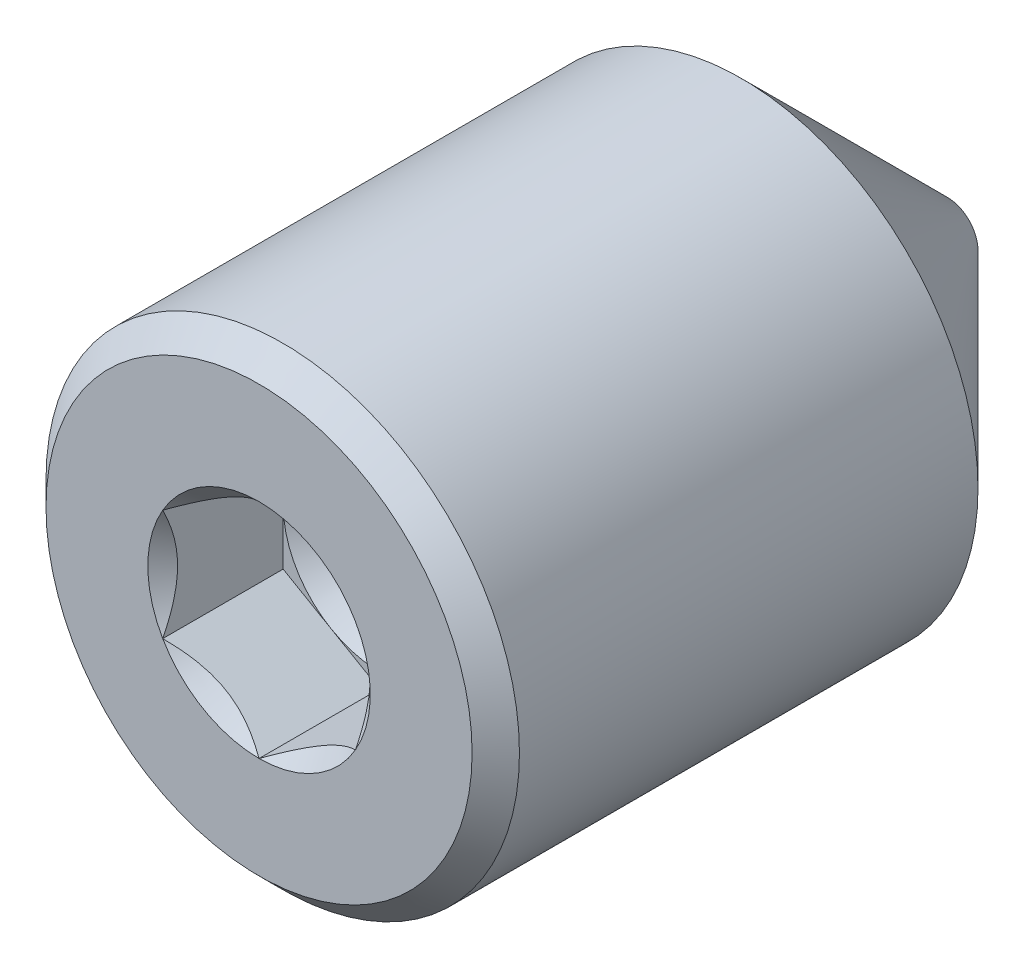
ISO-10303-21;
HEADER;
FILE_DESCRIPTION(('STEP AP214'),'2;1');
FILE_NAME('part.step','',(''),(''),'','','');
FILE_SCHEMA(('AUTOMOTIVE_DESIGN { 1 0 10303 214 1 1 1 1 }'));
ENDSEC;
DATA;
#1=APPLICATION_CONTEXT('core data for automotive mechanical design processes');
#2=APPLICATION_PROTOCOL_DEFINITION('international standard','automotive_design',2000,#1);
#3=PRODUCT_CONTEXT('',#1,'mechanical');
#4=PRODUCT('Part','Part','',(#3));
#5=PRODUCT_RELATED_PRODUCT_CATEGORY('part','',(#4));
#6=PRODUCT_DEFINITION_FORMATION('','',#4);
#7=PRODUCT_DEFINITION_CONTEXT('part definition',#1,'design');
#8=PRODUCT_DEFINITION('design','',#6,#7);
#9=PRODUCT_DEFINITION_SHAPE('','',#8);
#10=(LENGTH_UNIT() NAMED_UNIT(*) SI_UNIT(.MILLI.,.METRE.));
#11=(NAMED_UNIT(*) PLANE_ANGLE_UNIT() SI_UNIT($,.RADIAN.));
#12=(NAMED_UNIT(*) SI_UNIT($,.STERADIAN.) SOLID_ANGLE_UNIT());
#13=UNCERTAINTY_MEASURE_WITH_UNIT(LENGTH_MEASURE(1.E-05),#10,'distance_accuracy_value','');
#14=(GEOMETRIC_REPRESENTATION_CONTEXT(3) GLOBAL_UNCERTAINTY_ASSIGNED_CONTEXT((#13)) GLOBAL_UNIT_ASSIGNED_CONTEXT((#10,
#11,#12)) REPRESENTATION_CONTEXT('',''));
#15=CARTESIAN_POINT('',(0.,0.,0.));
#16=DIRECTION('',(0.,0.,1.));
#17=DIRECTION('',(1.,0.,0.));
#18=AXIS2_PLACEMENT_3D('',#15,#16,#17);
#19=CARTESIAN_POINT('',(0.,0.,1.031875));
#20=DIRECTION('',(0.,0.,1.));
#21=DIRECTION('',(1.,0.,0.));
#22=AXIS2_PLACEMENT_3D('',#19,#20,#21);
#23=PLANE('',#22);
#24=CARTESIAN_POINT('',(0.,0.,1.031875));
#25=DIRECTION('',(0.,0.,1.));
#26=DIRECTION('',(1.,0.,0.));
#27=AXIS2_PLACEMENT_3D('',#24,#25,#26);
#28=CIRCLE('',#27,0.4445);
#29=CARTESIAN_POINT('',(0.4445,0.,1.031875));
#30=VERTEX_POINT('',#29);
#31=CARTESIAN_POINT('',(0.22225,0.384948291982183,1.031875));
#32=VERTEX_POINT('',#31);
#33=EDGE_CURVE('E128',#30,#32,#28,.T.);
#34=ORIENTED_EDGE('',*,*,#33,.F.);
#35=DIRECTION('',(0.,1.,0.));
#36=VECTOR('',#35,1.);
#37=CARTESIAN_POINT('',(0.4445,-0.256632194654789,1.031875));
#38=LINE('',#37,#36);
#39=CARTESIAN_POINT('',(0.4445,0.256632194654789,1.031875));
#40=VERTEX_POINT('',#39);
#41=EDGE_CURVE('E160',#30,#40,#38,.T.);
#42=ORIENTED_EDGE('',*,*,#41,.T.);
#43=DIRECTION('',(-0.866025403784439,0.5,0.));
#44=VECTOR('',#43,1.);
#45=CARTESIAN_POINT('',(0.4445,0.256632194654789,1.031875));
#46=LINE('',#45,#44);
#47=EDGE_CURVE('E153',#40,#32,#46,.T.);
#48=ORIENTED_EDGE('',*,*,#47,.T.);
#49=EDGE_LOOP('',(#34,#42,#48));
#50=FACE_BOUND('',#49,.T.);
#51=ADVANCED_FACE('F43',(#50),#23,.T.);
#52=CARTESIAN_POINT('',(-0.22225,0.384948291982183,1.031875));
#53=VERTEX_POINT('',#52);
#54=EDGE_CURVE('E130',#32,#53,#28,.T.);
#55=ORIENTED_EDGE('',*,*,#54,.F.);
#56=CARTESIAN_POINT('',(0.,0.513264389309577,1.031875));
#57=VERTEX_POINT('',#56);
#58=EDGE_CURVE('E143',#32,#57,#46,.T.);
#59=ORIENTED_EDGE('',*,*,#58,.T.);
#60=DIRECTION('',(-0.866025403784439,-0.5,0.));
#61=VECTOR('',#60,1.);
#62=CARTESIAN_POINT('',(0.,0.513264389309577,1.031875));
#63=LINE('',#62,#61);
#64=EDGE_CURVE('E146',#57,#53,#63,.T.);
#65=ORIENTED_EDGE('',*,*,#64,.T.);
#66=EDGE_LOOP('',(#55,#59,#65));
#67=FACE_BOUND('',#66,.T.);
#68=ADVANCED_FACE('F142',(#67),#23,.T.);
#69=CARTESIAN_POINT('',(-0.4445,0.,1.031875));
#70=VERTEX_POINT('',#69);
#71=EDGE_CURVE('E148',#53,#70,#28,.T.);
#72=ORIENTED_EDGE('',*,*,#71,.F.);
#73=CARTESIAN_POINT('',(-0.4445,0.256632194654789,1.031875));
#74=VERTEX_POINT('',#73);
#75=EDGE_CURVE('E163',#53,#74,#63,.T.);
#76=ORIENTED_EDGE('',*,*,#75,.T.);
#77=DIRECTION('',(0.,-1.,0.));
#78=VECTOR('',#77,1.);
#79=CARTESIAN_POINT('',(-0.4445,0.256632194654789,1.031875));
#80=LINE('',#79,#78);
#81=EDGE_CURVE('E171',#74,#70,#80,.T.);
#82=ORIENTED_EDGE('',*,*,#81,.T.);
#83=EDGE_LOOP('',(#72,#76,#82));
#84=FACE_BOUND('',#83,.T.);
#85=ADVANCED_FACE('F238',(#84),#23,.T.);
#86=CARTESIAN_POINT('',(-0.22225,-0.384948291982183,1.031875));
#87=VERTEX_POINT('',#86);
#88=EDGE_CURVE('E373',#70,#87,#28,.T.);
#89=ORIENTED_EDGE('',*,*,#88,.F.);
#90=CARTESIAN_POINT('',(-0.4445,-0.256632194654789,1.031875));
#91=VERTEX_POINT('',#90);
#92=EDGE_CURVE('E170',#70,#91,#80,.T.);
#93=ORIENTED_EDGE('',*,*,#92,.T.);
#94=DIRECTION('',(0.866025403784439,-0.5,0.));
#95=VECTOR('',#94,1.);
#96=CARTESIAN_POINT('',(-0.4445,-0.256632194654789,1.031875));
#97=LINE('',#96,#95);
#98=EDGE_CURVE('E262',#91,#87,#97,.T.);
#99=ORIENTED_EDGE('',*,*,#98,.T.);
#100=EDGE_LOOP('',(#89,#93,#99));
#101=FACE_BOUND('',#100,.T.);
#102=ADVANCED_FACE('F230',(#101),#23,.T.);
#103=CARTESIAN_POINT('',(0.22225,-0.384948291982183,1.031875));
#104=VERTEX_POINT('',#103);
#105=EDGE_CURVE('E65',#87,#104,#28,.T.);
#106=ORIENTED_EDGE('',*,*,#105,.F.);
#107=CARTESIAN_POINT('',(0.,-0.513264389309577,1.031875));
#108=VERTEX_POINT('',#107);
#109=EDGE_CURVE('E264',#87,#108,#97,.T.);
#110=ORIENTED_EDGE('',*,*,#109,.T.);
#111=DIRECTION('',(0.866025403784439,0.5,0.));
#112=VECTOR('',#111,1.);
#113=CARTESIAN_POINT('',(0.,-0.513264389309577,1.031875));
#114=LINE('',#113,#112);
#115=EDGE_CURVE('E260',#108,#104,#114,.T.);
#116=ORIENTED_EDGE('',*,*,#115,.T.);
#117=EDGE_LOOP('',(#106,#110,#116));
#118=FACE_BOUND('',#117,.T.);
#119=ADVANCED_FACE('F221',(#118),#23,.T.);
#120=CARTESIAN_POINT('',(0.,1.0922,1.5875));
#121=DIRECTION('',(0.,0.,-1.));
#122=DIRECTION('',(-1.,0.,0.));
#123=AXIS2_PLACEMENT_3D('',#120,#121,#122);
#124=PLANE('',#123);
#125=CARTESIAN_POINT('',(0.,0.,1.5875));
#126=DIRECTION('',(0.,0.,1.));
#127=DIRECTION('',(1.,0.,0.));
#128=AXIS2_PLACEMENT_3D('',#125,#126,#127);
#129=CIRCLE('',#128,0.513264389309577);
#130=CARTESIAN_POINT('',(-0.4445,0.256632194654789,1.5875));
#131=VERTEX_POINT('',#130);
#132=CARTESIAN_POINT('',(-0.4445,-0.256632194654789,1.5875));
#133=VERTEX_POINT('',#132);
#134=EDGE_CURVE('E72',#131,#133,#129,.T.);
#135=ORIENTED_EDGE('',*,*,#134,.F.);
#136=CARTESIAN_POINT('',(0.,0.513264389309577,1.5875));
#137=VERTEX_POINT('',#136);
#138=EDGE_CURVE('E347',#137,#131,#129,.T.);
#139=ORIENTED_EDGE('',*,*,#138,.F.);
#140=CARTESIAN_POINT('',(0.4445,0.256632194654789,1.5875));
#141=VERTEX_POINT('',#140);
#142=EDGE_CURVE('E340',#141,#137,#129,.T.);
#143=ORIENTED_EDGE('',*,*,#142,.F.);
#144=CARTESIAN_POINT('',(0.4445,-0.256632194654789,1.5875));
#145=VERTEX_POINT('',#144);
#146=EDGE_CURVE('E137',#145,#141,#129,.T.);
#147=ORIENTED_EDGE('',*,*,#146,.F.);
#148=CARTESIAN_POINT('',(0.,-0.513264389309577,1.5875));
#149=VERTEX_POINT('',#148);
#150=EDGE_CURVE('E338',#149,#145,#129,.T.);
#151=ORIENTED_EDGE('',*,*,#150,.F.);
#152=EDGE_CURVE('E345',#133,#149,#129,.T.);
#153=ORIENTED_EDGE('',*,*,#152,.F.);
#154=EDGE_LOOP('',(#135,#139,#143,#147,#151,#153));
#155=FACE_BOUND('',#154,.T.);
#156=CARTESIAN_POINT('',(0.,0.,1.5875));
#157=DIRECTION('',(0.,0.,-1.));
#158=DIRECTION('',(-1.,0.,0.));
#159=AXIS2_PLACEMENT_3D('',#156,#157,#158);
#160=CIRCLE('',#159,0.982979999999999);
#161=CARTESIAN_POINT('',(-0.982979999999999,0.,1.5875));
#162=VERTEX_POINT('',#161);
#163=EDGE_CURVE('E203',#162,#162,#160,.F.);
#164=ORIENTED_EDGE('',*,*,#163,.T.);
#165=EDGE_LOOP('',(#164));
#166=FACE_BOUND('',#165,.T.);
#167=ADVANCED_FACE('F218',(#155,#166),#124,.F.);
#168=CARTESIAN_POINT('',(0.,0.,-1.5875));
#169=DIRECTION('',(0.,0.,1.));
#170=DIRECTION('',(1.,0.,0.));
#171=AXIS2_PLACEMENT_3D('',#168,#169,#170);
#172=PLANE('',#171);
#173=CARTESIAN_POINT('',(0.,0.,-1.5875));
#174=DIRECTION('',(0.,0.,1.));
#175=DIRECTION('',(1.,0.,0.));
#176=AXIS2_PLACEMENT_3D('',#173,#174,#175);
#177=CIRCLE('',#176,0.141986);
#178=CARTESIAN_POINT('',(0.141986,0.,-1.5875));
#179=VERTEX_POINT('',#178);
#180=EDGE_CURVE('E199',#179,#179,#177,.T.);
#181=ORIENTED_EDGE('',*,*,#180,.F.);
#182=EDGE_LOOP('',(#181));
#183=FACE_BOUND('',#182,.T.);
#184=ADVANCED_FACE('F220',(#183),#172,.F.);
#185=CARTESIAN_POINT('',(0.,0.,-1.5875));
#186=DIRECTION('',(0.,0.,1.));
#187=DIRECTION('',(1.,0.,0.));
#188=AXIS2_PLACEMENT_3D('',#185,#186,#187);
#189=CONICAL_SURFACE('',#188,0.141986,0.78539816339745);
#190=CARTESIAN_POINT('',(0.,0.,-0.637286000000003));
#191=DIRECTION('',(0.,0.,1.));
#192=DIRECTION('',(1.,0.,0.));
#193=AXIS2_PLACEMENT_3D('',#190,#191,#192);
#194=CIRCLE('',#193,1.0922);
#195=CARTESIAN_POINT('',(1.0922,0.,-0.637286000000003));
#196=VERTEX_POINT('',#195);
#197=EDGE_CURVE('E180',#196,#196,#194,.T.);
#198=CARTESIAN_POINT('',(1.0922,0.,-0.637286000000003));
#199=CARTESIAN_POINT('',(1.0823019375,0.,-0.647184062500003));
#200=CARTESIAN_POINT('',(1.072403875,0.,-0.657082125000003));
#201=CARTESIAN_POINT('',(1.05260775,0.,-0.676878250000003));
#202=CARTESIAN_POINT('',(1.0427096875,0.,-0.686776312500003));
#203=CARTESIAN_POINT('',(1.0229135625,0.,-0.706572437500003));
#204=CARTESIAN_POINT('',(1.0130155,0.,-0.716470500000003));
#205=CARTESIAN_POINT('',(0.993219375,0.,-0.736266625000003));
#206=CARTESIAN_POINT('',(0.9833213125,0.,-0.746164687500003));
#207=CARTESIAN_POINT('',(0.9635251875,0.,-0.765960812500003));
#208=CARTESIAN_POINT('',(0.953627125,0.,-0.775858875000003));
#209=CARTESIAN_POINT('',(0.933831,0.,-0.795655000000003));
#210=CARTESIAN_POINT('',(0.9239329375,0.,-0.805553062500003));
#211=CARTESIAN_POINT('',(0.9041368125,0.,-0.825349187500003));
#212=CARTESIAN_POINT('',(0.89423875,0.,-0.835247250000003));
#213=CARTESIAN_POINT('',(0.874442625,0.,-0.855043375000002));
#214=CARTESIAN_POINT('',(0.8645445625,0.,-0.864941437500003));
#215=CARTESIAN_POINT('',(0.8447484375,0.,-0.884737562500002));
#216=CARTESIAN_POINT('',(0.834850375,0.,-0.894635625000002));
#217=CARTESIAN_POINT('',(0.81505425,0.,-0.914431750000002));
#218=CARTESIAN_POINT('',(0.8051561875,0.,-0.924329812500002));
#219=CARTESIAN_POINT('',(0.7853600625,0.,-0.944125937500002));
#220=CARTESIAN_POINT('',(0.775462,0.,-0.954024000000002));
#221=CARTESIAN_POINT('',(0.755665875,0.,-0.973820125000002));
#222=CARTESIAN_POINT('',(0.7457678125,0.,-0.983718187500002));
#223=CARTESIAN_POINT('',(0.7259716875,0.,-1.0035143125));
#224=CARTESIAN_POINT('',(0.716073625,0.,-1.013412375));
#225=CARTESIAN_POINT('',(0.6962775,0.,-1.0332085));
#226=CARTESIAN_POINT('',(0.6863794375,0.,-1.0431065625));
#227=CARTESIAN_POINT('',(0.6665833125,0.,-1.0629026875));
#228=CARTESIAN_POINT('',(0.65668525,0.,-1.07280075));
#229=CARTESIAN_POINT('',(0.636889125,0.,-1.092596875));
#230=CARTESIAN_POINT('',(0.6269910625,0.,-1.1024949375));
#231=CARTESIAN_POINT('',(0.6071949375,0.,-1.1222910625));
#232=CARTESIAN_POINT('',(0.597296875,0.,-1.132189125));
#233=CARTESIAN_POINT('',(0.57750075,0.,-1.15198525));
#234=CARTESIAN_POINT('',(0.5676026875,0.,-1.1618833125));
#235=CARTESIAN_POINT('',(0.5478065625,0.,-1.1816794375));
#236=CARTESIAN_POINT('',(0.5379085,0.,-1.1915775));
#237=CARTESIAN_POINT('',(0.518112375,0.,-1.211373625));
#238=CARTESIAN_POINT('',(0.5082143125,0.,-1.2212716875));
#239=CARTESIAN_POINT('',(0.4884181875,0.,-1.2410678125));
#240=CARTESIAN_POINT('',(0.478520125,0.,-1.250965875));
#241=CARTESIAN_POINT('',(0.458724,0.,-1.270762));
#242=CARTESIAN_POINT('',(0.4488259375,0.,-1.2806600625));
#243=CARTESIAN_POINT('',(0.4290298125,0.,-1.3004561875));
#244=CARTESIAN_POINT('',(0.41913175,0.,-1.31035425));
#245=CARTESIAN_POINT('',(0.399335625,0.,-1.330150375));
#246=CARTESIAN_POINT('',(0.3894375625,0.,-1.3400484375));
#247=CARTESIAN_POINT('',(0.3696414375,0.,-1.3598445625));
#248=CARTESIAN_POINT('',(0.359743375,0.,-1.369742625));
#249=CARTESIAN_POINT('',(0.33994725,0.,-1.38953875));
#250=CARTESIAN_POINT('',(0.3300491875,0.,-1.3994368125));
#251=CARTESIAN_POINT('',(0.3102530625,0.,-1.4192329375));
#252=CARTESIAN_POINT('',(0.300355,0.,-1.429131));
#253=CARTESIAN_POINT('',(0.280558875,0.,-1.448927125));
#254=CARTESIAN_POINT('',(0.2706608125,0.,-1.4588251875));
#255=CARTESIAN_POINT('',(0.2508646875,0.,-1.4786213125));
#256=CARTESIAN_POINT('',(0.240966625,0.,-1.488519375));
#257=CARTESIAN_POINT('',(0.2211705,0.,-1.5083155));
#258=CARTESIAN_POINT('',(0.2112724375,0.,-1.5182135625));
#259=CARTESIAN_POINT('',(0.1914763125,0.,-1.5380096875));
#260=CARTESIAN_POINT('',(0.18157825,0.,-1.54790775));
#261=CARTESIAN_POINT('',(0.161782125,0.,-1.567703875));
#262=CARTESIAN_POINT('',(0.1518840625,0.,-1.5776019375));
#263=CARTESIAN_POINT('',(0.141986,0.,-1.5875));
#264=B_SPLINE_CURVE_WITH_KNOTS('',3,(#198,#199,#200,#201,#202,#203,#204,#205,#206,#207,#208,
#209,#210,#211,#212,#213,#214,#215,#216,#217,#218,#219,#220,#221,#222,#223,#224,#225,#226,#227,
#228,#229,#230,#231,#232,#233,#234,#235,#236,#237,#238,#239,#240,#241,#242,#243,#244,#245,#246,
#247,#248,#249,#250,#251,#252,#253,#254,#255,#256,#257,#258,#259,#260,#261,#262,#263),
.UNSPECIFIED.,.F.,.F.,(4,2,2,2,2,2,2,2,2,2,2,2,2,2,2,2,2,2,2,2,2,2,2,2,2,2,2,2,2,2,2,2,4),(0.,
0.0419939226861495,0.083987845372299,0.125981768058449,0.167975690744598,0.209969613430748,
0.251963536116897,0.293957458803047,0.335951381489196,0.377945304175346,0.419939226861495,
0.461933149547645,0.503927072233794,0.545920994919944,0.587914917606094,0.629908840292243,
0.671902762978393,0.713896685664542,0.755890608350692,0.797884531036841,0.839878453722991,
0.88187237640914,0.92386629909529,0.96586022178144,1.00785414446759,1.04984806715374,
1.09184198983989,1.13383591252604,1.17582983521219,1.21782375789834,1.25981768058449,
1.30181160327064,1.34380552595679),.UNSPECIFIED.);
#265=EDGE_CURVE('BSEAM227',#196,#179,#264,.T.);
#266=ORIENTED_EDGE('',*,*,#197,.F.);
#267=ORIENTED_EDGE('',*,*,#180,.T.);
#268=ORIENTED_EDGE('',*,*,#265,.T.);
#269=ORIENTED_EDGE('',*,*,#265,.F.);
#270=EDGE_LOOP('',(#266,#268,#267,#269));
#271=FACE_BOUND('',#270,.T.);
#272=ADVANCED_FACE('F227',(#271),#189,.T.);
#273=CARTESIAN_POINT('',(0.,0.,1.5875));
#274=DIRECTION('',(0.,0.,1.));
#275=DIRECTION('',(1.,0.,0.));
#276=AXIS2_PLACEMENT_3D('',#273,#274,#275);
#277=CYLINDRICAL_SURFACE('',#276,1.0922);
#278=CARTESIAN_POINT('',(0.,0.,1.47828));
#279=DIRECTION('',(0.,0.,-1.));
#280=DIRECTION('',(-1.,0.,0.));
#281=AXIS2_PLACEMENT_3D('',#278,#279,#280);
#282=CIRCLE('',#281,1.0922);
#283=CARTESIAN_POINT('',(-1.0922,0.,1.47828));
#284=VERTEX_POINT('',#283);
#285=EDGE_CURVE('E58',#284,#284,#282,.T.);
#286=ORIENTED_EDGE('',*,*,#285,.T.);
#287=EDGE_LOOP('',(#286));
#288=FACE_BOUND('',#287,.T.);
#289=ORIENTED_EDGE('',*,*,#197,.T.);
#290=EDGE_LOOP('',(#289));
#291=FACE_BOUND('',#290,.T.);
#292=ADVANCED_FACE('F210',(#288,#291),#277,.T.);
#293=CARTESIAN_POINT('',(0.,0.,1.5875));
#294=DIRECTION('',(0.,0.,-1.));
#295=DIRECTION('',(-1.,0.,0.));
#296=AXIS2_PLACEMENT_3D('',#293,#294,#295);
#297=CONICAL_SURFACE('',#296,0.982979999999999,0.785398163397449);
#298=ORIENTED_EDGE('',*,*,#285,.F.);
#299=EDGE_LOOP('',(#298));
#300=FACE_BOUND('',#299,.T.);
#301=ORIENTED_EDGE('',*,*,#163,.F.);
#302=EDGE_LOOP('',(#301));
#303=FACE_BOUND('',#302,.T.);
#304=ADVANCED_FACE('F45',(#300,#303),#297,.T.);
#305=CARTESIAN_POINT('',(0.,0.,1.5875));
#306=DIRECTION('',(0.,0.,1.));
#307=DIRECTION('',(1.,0.,0.));
#308=AXIS2_PLACEMENT_3D('',#305,#306,#307);
#309=CONICAL_SURFACE('',#308,0.513264389309577,0.78539816339745);
#310=ORIENTED_EDGE('',*,*,#150,.T.);
#311=CARTESIAN_POINT('',(-0.0002,-0.513379859363415,1.58761550901134));
#312=CARTESIAN_POINT('',(0.0150904282118539,-0.504551926519277,1.57879110057877));
#313=CARTESIAN_POINT('',(0.0306356020737622,-0.495576916205504,1.57048369800426));
#314=CARTESIAN_POINT('',(0.062334522171274,-0.477275536154186,1.55527217648255));
#315=CARTESIAN_POINT('',(0.0784912919900499,-0.46794742075008,1.54837653497958));
#316=CARTESIAN_POINT('',(0.111072821191352,-0.449136466095099,1.53656532909836));
#317=CARTESIAN_POINT('',(0.127489226842223,-0.439658449873443,1.53162000653154));
#318=CARTESIAN_POINT('',(0.160675819647773,-0.420498161583672,1.52399425328559));
#319=CARTESIAN_POINT('',(0.177445009476572,-0.410816465321923,1.52130813855292));
#320=CARTESIAN_POINT('',(0.218398789762252,-0.387171789249653,1.51790059470567));
#321=CARTESIAN_POINT('',(0.242679011495559,-0.373153596695944,1.51851597726105));
#322=CARTESIAN_POINT('',(0.290730642294787,-0.345410974719009,1.52486355231913));
#323=CARTESIAN_POINT('',(0.314501236586314,-0.331687015705999,1.53060339160416));
#324=CARTESIAN_POINT('',(0.35625956641124,-0.307577832740669,1.54444991575862));
#325=CARTESIAN_POINT('',(0.374438773811146,-0.297082062454679,1.55183610594815));
#326=CARTESIAN_POINT('',(0.410084463318693,-0.276502014022047,1.56847634221814));
#327=CARTESIAN_POINT('',(0.427553046543219,-0.266416522795005,1.57772431448012));
#328=CARTESIAN_POINT('',(0.4447,-0.256516724600951,1.58761550901134));
#329=B_SPLINE_CURVE_WITH_KNOTS('',3,(#311,#312,#313,#314,#315,#316,#317,#318,#319,#320,#321,
#322,#323,#324,#325,#326,#327,#328),.UNSPECIFIED.,.F.,.F.,(4,2,2,2,2,2,2,2,4),(0.,
0.0592545741399769,0.118855153084928,0.177507465081246,0.236011765586855,0.319609015700824,
0.403331219627383,0.469995632162209,0.536445986043464),.UNSPECIFIED.);
#330=EDGE_CURVE('E11',#149,#145,#329,.T.);
#331=ORIENTED_EDGE('',*,*,#330,.F.);
#332=EDGE_LOOP('',(#310,#331));
#333=FACE_BOUND('',#332,.T.);
#334=ADVANCED_FACE('F215',(#333),#309,.F.);
#335=ORIENTED_EDGE('',*,*,#146,.T.);
#336=CARTESIAN_POINT('',(0.4445,-0.511829342433522,1.75213643365491));
#337=CARTESIAN_POINT('',(0.4445,-0.486891084889183,1.73335043903489));
#338=CARTESIAN_POINT('',(0.4445,-0.461691007430873,1.71487650452443));
#339=CARTESIAN_POINT('',(0.4445,-0.410329660721343,1.67888215067854));
#340=CARTESIAN_POINT('',(0.4445,-0.384162428854917,1.66137028941977));
#341=CARTESIAN_POINT('',(0.4445,-0.329287980819697,1.62698306467267));
#342=CARTESIAN_POINT('',(0.4445,-0.300521037965712,1.61020108521017));
#343=CARTESIAN_POINT('',(0.4445,-0.241568559840238,1.57951080681276));
#344=CARTESIAN_POINT('',(0.4445,-0.211388245708777,1.56559281970172));
#345=CARTESIAN_POINT('',(0.4445,-0.151771739698241,1.54319085629548));
#346=CARTESIAN_POINT('',(0.4445,-0.122473115330602,1.53435817273981));
#347=CARTESIAN_POINT('',(0.4445,-0.0632241889330757,1.52230015674214));
#348=CARTESIAN_POINT('',(0.4445,-0.0332958391310471,1.51897451118934));
#349=CARTESIAN_POINT('',(0.4445,0.0255238480886845,1.51853005778441));
#350=CARTESIAN_POINT('',(0.4445,0.0544135352957961,1.52119107502173));
#351=CARTESIAN_POINT('',(0.4445,0.111708480695749,1.53166779172838));
#352=CARTESIAN_POINT('',(0.4445,0.14009591628793,1.53957455636983));
#353=CARTESIAN_POINT('',(0.4445,0.198086494530433,1.5600441544018));
#354=CARTESIAN_POINT('',(0.4445,0.227553507232478,1.57297446691827));
#355=CARTESIAN_POINT('',(0.4445,0.285120497610206,1.60173046740548));
#356=CARTESIAN_POINT('',(0.4445,0.313215089215117,1.6175665579926));
#357=CARTESIAN_POINT('',(0.4445,0.366904764676342,1.65022724091409));
#358=CARTESIAN_POINT('',(0.4445,0.392554679985773,1.66696360640843));
#359=CARTESIAN_POINT('',(0.4445,0.442864748703385,1.70144464599535));
#360=CARTESIAN_POINT('',(0.4445,0.467531279975358,1.71917995695485));
#361=CARTESIAN_POINT('',(0.4445,0.491928973864434,1.73723965692793));
#362=B_SPLINE_CURVE_WITH_KNOTS('',3,(#336,#337,#338,#339,#340,#341,#342,#343,#344,#345,#346,
#347,#348,#349,#350,#351,#352,#353,#354,#355,#356,#357,#358,#359,#360,#361),.UNSPECIFIED.,.F.,
.F.,(4,2,2,2,2,2,2,2,2,2,2,2,4),(0.,0.0936965174450126,0.188123619017623,0.287940507610602,
0.387413978831585,0.478834218818951,0.568570106804051,0.655059880285827,0.743091820256316,
0.839389678312889,0.936039255964515,1.02788603853754,1.11898185125655),.UNSPECIFIED.);
#363=EDGE_CURVE('E295',#145,#141,#362,.T.);
#364=ORIENTED_EDGE('',*,*,#363,.F.);
#365=EDGE_LOOP('',(#335,#364));
#366=FACE_BOUND('',#365,.T.);
#367=ADVANCED_FACE('F430',(#366),#309,.F.);
#368=ORIENTED_EDGE('',*,*,#142,.T.);
#369=CARTESIAN_POINT('',(0.4447,0.256516724600951,1.58761550901134));
#370=CARTESIAN_POINT('',(0.429409571788146,0.265344657445089,1.57879110057877));
#371=CARTESIAN_POINT('',(0.413864397926238,0.274319667758862,1.57048369800426));
#372=CARTESIAN_POINT('',(0.382165477828726,0.29262104781018,1.55527217648255));
#373=CARTESIAN_POINT('',(0.36600870800995,0.301949163214285,1.54837653497958));
#374=CARTESIAN_POINT('',(0.333427178808648,0.320760117869267,1.53656532909836));
#375=CARTESIAN_POINT('',(0.317010773157777,0.330238134090923,1.53162000653154));
#376=CARTESIAN_POINT('',(0.283824180352226,0.349398422380694,1.52399425328559));
#377=CARTESIAN_POINT('',(0.267054990523428,0.359080118642443,1.52130813855292));
#378=CARTESIAN_POINT('',(0.226101210237748,0.382724794714713,1.51790059470567));
#379=CARTESIAN_POINT('',(0.201820988504441,0.396742987268422,1.51851597726105));
#380=CARTESIAN_POINT('',(0.153769357705213,0.424485609245357,1.52486355231913));
#381=CARTESIAN_POINT('',(0.129998763413685,0.438209568258368,1.53060339160416));
#382=CARTESIAN_POINT('',(0.0882404335887596,0.462318751223698,1.54444991575862));
#383=CARTESIAN_POINT('',(0.0700612261888539,0.472814521509687,1.55183610594815));
#384=CARTESIAN_POINT('',(0.0344155366813068,0.493394569942319,1.56847634221814));
#385=CARTESIAN_POINT('',(0.0169469534567807,0.503480061169361,1.57772431448012));
#386=CARTESIAN_POINT('',(-0.000200000000000038,0.513379859363415,1.58761550901134));
#387=B_SPLINE_CURVE_WITH_KNOTS('',3,(#369,#370,#371,#372,#373,#374,#375,#376,#377,#378,#379,
#380,#381,#382,#383,#384,#385,#386),.UNSPECIFIED.,.F.,.F.,(4,2,2,2,2,2,2,2,4),(0.,
0.0592545741399767,0.118855153084928,0.177507465081246,0.236011765586855,0.319609015700824,
0.403331219627383,0.46999563216221,0.536445986043464),.UNSPECIFIED.);
#388=EDGE_CURVE('E304',#141,#137,#387,.T.);
#389=ORIENTED_EDGE('',*,*,#388,.F.);
#390=EDGE_LOOP('',(#368,#389));
#391=FACE_BOUND('',#390,.T.);
#392=ADVANCED_FACE('F421',(#391),#309,.F.);
#393=ORIENTED_EDGE('',*,*,#138,.T.);
#394=CARTESIAN_POINT('',(0.000200000000000019,0.513379859363415,1.58761550901134));
#395=CARTESIAN_POINT('',(-0.0150904282118539,0.504551926519277,1.57879110057877));
#396=CARTESIAN_POINT('',(-0.0306356020737621,0.495576916205504,1.57048369800426));
#397=CARTESIAN_POINT('',(-0.0623345221712739,0.477275536154186,1.55527217648255));
#398=CARTESIAN_POINT('',(-0.0784912919900498,0.46794742075008,1.54837653497958));
#399=CARTESIAN_POINT('',(-0.111072821191352,0.449136466095099,1.53656532909836));
#400=CARTESIAN_POINT('',(-0.127489226842222,0.439658449873443,1.53162000653154));
#401=CARTESIAN_POINT('',(-0.160675819647773,0.420498161583672,1.52399425328559));
#402=CARTESIAN_POINT('',(-0.177445009476572,0.410816465321923,1.52130813855292));
#403=CARTESIAN_POINT('',(-0.218398789762252,0.387171789249653,1.51790059470567));
#404=CARTESIAN_POINT('',(-0.242679011495559,0.373153596695944,1.51851597726105));
#405=CARTESIAN_POINT('',(-0.290730642294787,0.345410974719009,1.52486355231913));
#406=CARTESIAN_POINT('',(-0.314501236586314,0.331687015705999,1.53060339160416));
#407=CARTESIAN_POINT('',(-0.35625956641124,0.307577832740669,1.54444991575862));
#408=CARTESIAN_POINT('',(-0.374438773811146,0.297082062454679,1.55183610594815));
#409=CARTESIAN_POINT('',(-0.410084463318693,0.276502014022047,1.56847634221814));
#410=CARTESIAN_POINT('',(-0.427553046543219,0.266416522795005,1.57772431448012));
#411=CARTESIAN_POINT('',(-0.4447,0.256516724600951,1.58761550901134));
#412=B_SPLINE_CURVE_WITH_KNOTS('',3,(#394,#395,#396,#397,#398,#399,#400,#401,#402,#403,#404,
#405,#406,#407,#408,#409,#410,#411),.UNSPECIFIED.,.F.,.F.,(4,2,2,2,2,2,2,2,4),(0.,
0.0592545741399768,0.118855153084928,0.177507465081246,0.236011765586855,0.319609015700824,
0.403331219627383,0.46999563216221,0.536445986043464),.UNSPECIFIED.);
#413=EDGE_CURVE('E310',#137,#131,#412,.T.);
#414=ORIENTED_EDGE('',*,*,#413,.F.);
#415=EDGE_LOOP('',(#393,#414));
#416=FACE_BOUND('',#415,.T.);
#417=ADVANCED_FACE('F412',(#416),#309,.F.);
#418=ORIENTED_EDGE('',*,*,#134,.T.);
#419=CARTESIAN_POINT('',(-0.4445,-0.511829342433522,1.75213643365491));
#420=CARTESIAN_POINT('',(-0.4445,-0.486891084889183,1.73335043903489));
#421=CARTESIAN_POINT('',(-0.4445,-0.461691007430874,1.71487650452443));
#422=CARTESIAN_POINT('',(-0.4445,-0.410329660721343,1.67888215067854));
#423=CARTESIAN_POINT('',(-0.4445,-0.384162428854917,1.66137028941977));
#424=CARTESIAN_POINT('',(-0.4445,-0.329287980819697,1.62698306467267));
#425=CARTESIAN_POINT('',(-0.4445,-0.300521037965712,1.61020108521017));
#426=CARTESIAN_POINT('',(-0.4445,-0.241568559840238,1.57951080681276));
#427=CARTESIAN_POINT('',(-0.4445,-0.211388245708777,1.56559281970172));
#428=CARTESIAN_POINT('',(-0.4445,-0.151771739698241,1.54319085629548));
#429=CARTESIAN_POINT('',(-0.4445,-0.122473115330602,1.53435817273981));
#430=CARTESIAN_POINT('',(-0.4445,-0.0632241889330757,1.52230015674214));
#431=CARTESIAN_POINT('',(-0.4445,-0.0332958391310472,1.51897451118934));
#432=CARTESIAN_POINT('',(-0.4445,0.0255238480886844,1.51853005778441));
#433=CARTESIAN_POINT('',(-0.4445,0.0544135352957959,1.52119107502173));
#434=CARTESIAN_POINT('',(-0.4445,0.111708480695749,1.53166779172838));
#435=CARTESIAN_POINT('',(-0.4445,0.140095916287929,1.53957455636983));
#436=CARTESIAN_POINT('',(-0.4445,0.198086494530433,1.5600441544018));
#437=CARTESIAN_POINT('',(-0.4445,0.227553507232478,1.57297446691827));
#438=CARTESIAN_POINT('',(-0.4445,0.285120497610205,1.60173046740548));
#439=CARTESIAN_POINT('',(-0.4445,0.313215089215117,1.6175665579926));
#440=CARTESIAN_POINT('',(-0.4445,0.366904764676342,1.65022724091409));
#441=CARTESIAN_POINT('',(-0.4445,0.392554679985773,1.66696360640843));
#442=CARTESIAN_POINT('',(-0.4445,0.442864748703384,1.70144464599535));
#443=CARTESIAN_POINT('',(-0.4445,0.467531279975358,1.71917995695485));
#444=CARTESIAN_POINT('',(-0.4445,0.491928973864433,1.73723965692793));
#445=B_SPLINE_CURVE_WITH_KNOTS('',3,(#419,#420,#421,#422,#423,#424,#425,#426,#427,#428,#429,
#430,#431,#432,#433,#434,#435,#436,#437,#438,#439,#440,#441,#442,#443,#444),.UNSPECIFIED.,.F.,
.F.,(4,2,2,2,2,2,2,2,2,2,2,2,4),(0.,0.0936965174450127,0.188123619017623,0.287940507610602,
0.387413978831585,0.478834218818951,0.568570106804051,0.655059880285827,0.743091820256315,
0.839389678312888,0.936039255964514,1.02788603853754,1.11898185125655),.UNSPECIFIED.);
#446=EDGE_CURVE('E281',#131,#133,#445,.F.);
#447=ORIENTED_EDGE('',*,*,#446,.F.);
#448=EDGE_LOOP('',(#418,#447));
#449=FACE_BOUND('',#448,.T.);
#450=ADVANCED_FACE('F250',(#449),#309,.F.);
#451=ORIENTED_EDGE('',*,*,#152,.T.);
#452=CARTESIAN_POINT('',(-0.4447,-0.256516724600951,1.58761550901134));
#453=CARTESIAN_POINT('',(-0.429409571788146,-0.265344657445089,1.57879110057877));
#454=CARTESIAN_POINT('',(-0.413864397926238,-0.274319667758862,1.57048369800426));
#455=CARTESIAN_POINT('',(-0.382165477828726,-0.29262104781018,1.55527217648255));
#456=CARTESIAN_POINT('',(-0.36600870800995,-0.301949163214286,1.54837653497958));
#457=CARTESIAN_POINT('',(-0.333427178808648,-0.320760117869267,1.53656532909836));
#458=CARTESIAN_POINT('',(-0.317010773157777,-0.330238134090923,1.53162000653154));
#459=CARTESIAN_POINT('',(-0.283824180352227,-0.349398422380694,1.52399425328559));
#460=CARTESIAN_POINT('',(-0.267054990523428,-0.359080118642443,1.52130813855292));
#461=CARTESIAN_POINT('',(-0.226101210237748,-0.382724794714713,1.51790059470567));
#462=CARTESIAN_POINT('',(-0.201820988504441,-0.396742987268422,1.51851597726105));
#463=CARTESIAN_POINT('',(-0.153769357705213,-0.424485609245357,1.52486355231913));
#464=CARTESIAN_POINT('',(-0.129998763413685,-0.438209568258367,1.53060339160416));
#465=CARTESIAN_POINT('',(-0.0882404335887598,-0.462318751223697,1.54444991575862));
#466=CARTESIAN_POINT('',(-0.0700612261888541,-0.472814521509687,1.55183610594815));
#467=CARTESIAN_POINT('',(-0.0344155366813069,-0.493394569942319,1.56847634221814));
#468=CARTESIAN_POINT('',(-0.0169469534567808,-0.503480061169361,1.57772431448012));
#469=CARTESIAN_POINT('',(0.000200000000000003,-0.513379859363415,1.58761550901134));
#470=B_SPLINE_CURVE_WITH_KNOTS('',3,(#452,#453,#454,#455,#456,#457,#458,#459,#460,#461,#462,
#463,#464,#465,#466,#467,#468,#469),.UNSPECIFIED.,.F.,.F.,(4,2,2,2,2,2,2,2,4),(0.,
0.0592545741399769,0.118855153084928,0.177507465081246,0.236011765586855,0.319609015700824,
0.403331219627383,0.46999563216221,0.536445986043464),.UNSPECIFIED.);
#471=EDGE_CURVE('E272',#133,#149,#470,.T.);
#472=ORIENTED_EDGE('',*,*,#471,.F.);
#473=EDGE_LOOP('',(#451,#472));
#474=FACE_BOUND('',#473,.T.);
#475=ADVANCED_FACE('F242',(#474),#309,.F.);
#476=EDGE_CURVE('E132',#104,#30,#28,.T.);
#477=ORIENTED_EDGE('',*,*,#476,.F.);
#478=CARTESIAN_POINT('',(0.4445,-0.256632194654789,1.031875));
#479=VERTEX_POINT('',#478);
#480=EDGE_CURVE('E254',#104,#479,#114,.T.);
#481=ORIENTED_EDGE('',*,*,#480,.T.);
#482=EDGE_CURVE('E158',#479,#30,#38,.T.);
#483=ORIENTED_EDGE('',*,*,#482,.T.);
#484=EDGE_LOOP('',(#477,#481,#483));
#485=FACE_BOUND('',#484,.T.);
#486=ADVANCED_FACE('F233',(#485),#23,.T.);
#487=CARTESIAN_POINT('',(0.,-0.513264389309577,1.031875));
#488=DIRECTION('',(0.5,-0.866025403784439,0.));
#489=DIRECTION('',(0.866025403784439,0.5,0.));
#490=AXIS2_PLACEMENT_3D('',#487,#488,#489);
#491=PLANE('',#490);
#492=DIRECTION('',(0.,0.,1.));
#493=VECTOR('',#492,1.);
#494=CARTESIAN_POINT('',(0.,-0.513264389309577,1.031875));
#495=LINE('',#494,#493);
#496=EDGE_CURVE('E175',#108,#149,#495,.T.);
#497=ORIENTED_EDGE('',*,*,#496,.T.);
#498=ORIENTED_EDGE('',*,*,#330,.T.);
#499=DIRECTION('',(0.,0.,1.));
#500=VECTOR('',#499,1.);
#501=CARTESIAN_POINT('',(0.4445,-0.256632194654789,1.031875));
#502=LINE('',#501,#500);
#503=EDGE_CURVE('E189',#479,#145,#502,.T.);
#504=ORIENTED_EDGE('',*,*,#503,.F.);
#505=ORIENTED_EDGE('',*,*,#480,.F.);
#506=ORIENTED_EDGE('',*,*,#115,.F.);
#507=EDGE_LOOP('',(#497,#498,#504,#505,#506));
#508=FACE_BOUND('',#507,.T.);
#509=ADVANCED_FACE('F241',(#508),#491,.F.);
#510=CARTESIAN_POINT('',(0.4445,-0.256632194654789,1.031875));
#511=DIRECTION('',(1.,0.,0.));
#512=DIRECTION('',(0.,0.,-1.));
#513=AXIS2_PLACEMENT_3D('',#510,#511,#512);
#514=PLANE('',#513);
#515=ORIENTED_EDGE('',*,*,#503,.T.);
#516=ORIENTED_EDGE('',*,*,#363,.T.);
#517=DIRECTION('',(0.,0.,1.));
#518=VECTOR('',#517,1.);
#519=CARTESIAN_POINT('',(0.4445,0.256632194654789,1.031875));
#520=LINE('',#519,#518);
#521=EDGE_CURVE('E186',#40,#141,#520,.T.);
#522=ORIENTED_EDGE('',*,*,#521,.F.);
#523=ORIENTED_EDGE('',*,*,#41,.F.);
#524=ORIENTED_EDGE('',*,*,#482,.F.);
#525=EDGE_LOOP('',(#515,#516,#522,#523,#524));
#526=FACE_BOUND('',#525,.T.);
#527=ADVANCED_FACE('F248',(#526),#514,.F.);
#528=CARTESIAN_POINT('',(0.4445,0.256632194654789,1.031875));
#529=DIRECTION('',(0.5,0.866025403784439,0.));
#530=DIRECTION('',(-0.866025403784439,0.5,0.));
#531=AXIS2_PLACEMENT_3D('',#528,#529,#530);
#532=PLANE('',#531);
#533=ORIENTED_EDGE('',*,*,#521,.T.);
#534=ORIENTED_EDGE('',*,*,#388,.T.);
#535=DIRECTION('',(0.,0.,1.));
#536=VECTOR('',#535,1.);
#537=CARTESIAN_POINT('',(0.,0.513264389309577,1.031875));
#538=LINE('',#537,#536);
#539=EDGE_CURVE('E156',#57,#137,#538,.T.);
#540=ORIENTED_EDGE('',*,*,#539,.F.);
#541=ORIENTED_EDGE('',*,*,#58,.F.);
#542=ORIENTED_EDGE('',*,*,#47,.F.);
#543=EDGE_LOOP('',(#533,#534,#540,#541,#542));
#544=FACE_BOUND('',#543,.T.);
#545=ADVANCED_FACE('F152',(#544),#532,.F.);
#546=CARTESIAN_POINT('',(0.,0.513264389309577,1.031875));
#547=DIRECTION('',(-0.5,0.866025403784439,0.));
#548=DIRECTION('',(-0.866025403784439,-0.5,0.));
#549=AXIS2_PLACEMENT_3D('',#546,#547,#548);
#550=PLANE('',#549);
#551=ORIENTED_EDGE('',*,*,#539,.T.);
#552=ORIENTED_EDGE('',*,*,#413,.T.);
#553=DIRECTION('',(0.,0.,1.));
#554=VECTOR('',#553,1.);
#555=CARTESIAN_POINT('',(-0.4445,0.256632194654789,1.031875));
#556=LINE('',#555,#554);
#557=EDGE_CURVE('E181',#74,#131,#556,.T.);
#558=ORIENTED_EDGE('',*,*,#557,.F.);
#559=ORIENTED_EDGE('',*,*,#75,.F.);
#560=ORIENTED_EDGE('',*,*,#64,.F.);
#561=EDGE_LOOP('',(#551,#552,#558,#559,#560));
#562=FACE_BOUND('',#561,.T.);
#563=ADVANCED_FACE('F318',(#562),#550,.F.);
#564=CARTESIAN_POINT('',(-0.4445,0.256632194654789,1.031875));
#565=DIRECTION('',(-1.,0.,0.));
#566=DIRECTION('',(0.,-1.,0.));
#567=AXIS2_PLACEMENT_3D('',#564,#565,#566);
#568=PLANE('',#567);
#569=ORIENTED_EDGE('',*,*,#557,.T.);
#570=ORIENTED_EDGE('',*,*,#446,.T.);
#571=DIRECTION('',(0.,0.,1.));
#572=VECTOR('',#571,1.);
#573=CARTESIAN_POINT('',(-0.4445,-0.256632194654789,1.031875));
#574=LINE('',#573,#572);
#575=EDGE_CURVE('E176',#91,#133,#574,.T.);
#576=ORIENTED_EDGE('',*,*,#575,.F.);
#577=ORIENTED_EDGE('',*,*,#92,.F.);
#578=ORIENTED_EDGE('',*,*,#81,.F.);
#579=EDGE_LOOP('',(#569,#570,#576,#577,#578));
#580=FACE_BOUND('',#579,.T.);
#581=ADVANCED_FACE('F321',(#580),#568,.F.);
#582=CARTESIAN_POINT('',(-0.4445,-0.256632194654789,1.031875));
#583=DIRECTION('',(-0.5,-0.866025403784439,0.));
#584=DIRECTION('',(0.866025403784439,-0.5,0.));
#585=AXIS2_PLACEMENT_3D('',#582,#583,#584);
#586=PLANE('',#585);
#587=ORIENTED_EDGE('',*,*,#575,.T.);
#588=ORIENTED_EDGE('',*,*,#471,.T.);
#589=ORIENTED_EDGE('',*,*,#496,.F.);
#590=ORIENTED_EDGE('',*,*,#109,.F.);
#591=ORIENTED_EDGE('',*,*,#98,.F.);
#592=EDGE_LOOP('',(#587,#588,#589,#590,#591));
#593=FACE_BOUND('',#592,.T.);
#594=ADVANCED_FACE('F125',(#593),#586,.F.);
#595=CARTESIAN_POINT('',(0.,0.,1.031875));
#596=DIRECTION('',(0.,0.,1.));
#597=DIRECTION('',(1.,0.,0.));
#598=AXIS2_PLACEMENT_3D('',#595,#596,#597);
#599=CONICAL_SURFACE('',#598,0.4445,0.78539816339745);
#600=CARTESIAN_POINT('',(0.,0.,0.587375000000001));
#601=VERTEX_POINT('',#600);
#602=VERTEX_LOOP('',#601);
#603=FACE_BOUND('',#602,.T.);
#604=ORIENTED_EDGE('',*,*,#33,.T.);
#605=ORIENTED_EDGE('',*,*,#54,.T.);
#606=ORIENTED_EDGE('',*,*,#71,.T.);
#607=ORIENTED_EDGE('',*,*,#88,.T.);
#608=ORIENTED_EDGE('',*,*,#105,.T.);
#609=ORIENTED_EDGE('',*,*,#476,.T.);
#610=EDGE_LOOP('',(#604,#605,#606,#607,#608,#609));
#611=FACE_BOUND('',#610,.T.);
#612=ADVANCED_FACE('F123',(#603,#611),#599,.F.);
#613=CLOSED_SHELL('',(#51,#68,#85,#102,#119,#167,#184,#272,#292,#304,#334,#367,#392,#417,#450,
#475,#486,#509,#527,#545,#563,#581,#594,#612));
#614=MANIFOLD_SOLID_BREP('B2',#613);
#615=ADVANCED_BREP_SHAPE_REPRESENTATION('',(#18,#614),#14);
#616=SHAPE_DEFINITION_REPRESENTATION(#9,#615);
ENDSEC;
END-ISO-10303-21;
